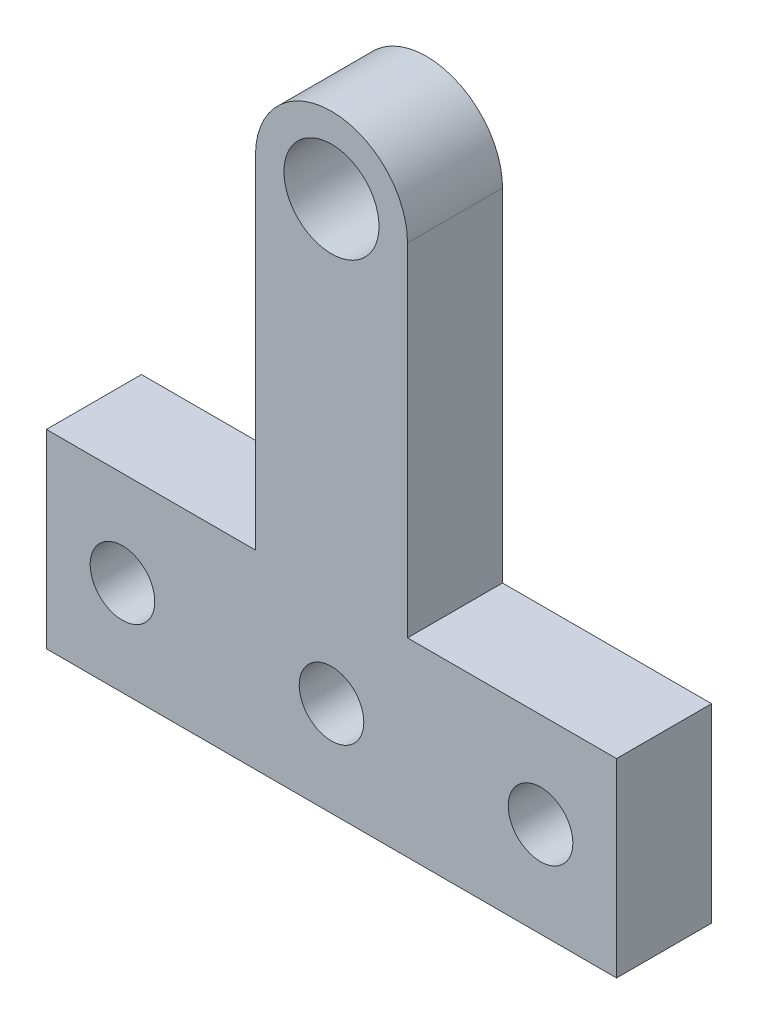
ISO-10303-21;
HEADER;
FILE_DESCRIPTION(('STEP AP214'),'2;1');
FILE_NAME('part.step','',(''),(''),'','','');
FILE_SCHEMA(('AUTOMOTIVE_DESIGN { 1 0 10303 214 1 1 1 1 }'));
ENDSEC;
DATA;
#1=APPLICATION_CONTEXT('core data for automotive mechanical design processes');
#2=APPLICATION_PROTOCOL_DEFINITION('international standard','automotive_design',2000,#1);
#3=PRODUCT_CONTEXT('',#1,'mechanical');
#4=PRODUCT('Part','Part','',(#3));
#5=PRODUCT_RELATED_PRODUCT_CATEGORY('part','',(#4));
#6=PRODUCT_DEFINITION_FORMATION('','',#4);
#7=PRODUCT_DEFINITION_CONTEXT('part definition',#1,'design');
#8=PRODUCT_DEFINITION('design','',#6,#7);
#9=PRODUCT_DEFINITION_SHAPE('','',#8);
#10=(LENGTH_UNIT() NAMED_UNIT(*) SI_UNIT(.MILLI.,.METRE.));
#11=(NAMED_UNIT(*) PLANE_ANGLE_UNIT() SI_UNIT($,.RADIAN.));
#12=(NAMED_UNIT(*) SI_UNIT($,.STERADIAN.) SOLID_ANGLE_UNIT());
#13=UNCERTAINTY_MEASURE_WITH_UNIT(LENGTH_MEASURE(1.E-05),#10,'distance_accuracy_value','');
#14=(GEOMETRIC_REPRESENTATION_CONTEXT(3) GLOBAL_UNCERTAINTY_ASSIGNED_CONTEXT((#13)) GLOBAL_UNIT_ASSIGNED_CONTEXT((#10,
#11,#12)) REPRESENTATION_CONTEXT('',''));
#15=CARTESIAN_POINT('',(0.,0.,0.));
#16=DIRECTION('',(0.,0.,1.));
#17=DIRECTION('',(1.,0.,0.));
#18=AXIS2_PLACEMENT_3D('',#15,#16,#17);
#19=CARTESIAN_POINT('',(0.,28.,0.));
#20=DIRECTION('',(0.,0.,1.));
#21=DIRECTION('',(1.,0.,0.));
#22=AXIS2_PLACEMENT_3D('',#19,#20,#21);
#23=PLANE('',#22);
#24=CARTESIAN_POINT('',(0.,28.,0.));
#25=DIRECTION('',(0.,0.,1.));
#26=DIRECTION('',(1.,0.,0.));
#27=AXIS2_PLACEMENT_3D('',#24,#25,#26);
#28=CIRCLE('',#27,2.5);
#29=CARTESIAN_POINT('',(2.5,28.,0.));
#30=VERTEX_POINT('',#29);
#31=EDGE_CURVE('E136',#30,#30,#28,.T.);
#32=ORIENTED_EDGE('',*,*,#31,.T.);
#33=EDGE_LOOP('',(#32));
#34=FACE_BOUND('',#33,.T.);
#35=DIRECTION('',(0.,1.,0.));
#36=VECTOR('',#35,1.);
#37=CARTESIAN_POINT('',(15.,10.,0.));
#38=LINE('',#37,#36);
#39=CARTESIAN_POINT('',(15.,0.,0.));
#40=VERTEX_POINT('',#39);
#41=CARTESIAN_POINT('',(15.,10.,0.));
#42=VERTEX_POINT('',#41);
#43=EDGE_CURVE('E132',#40,#42,#38,.T.);
#44=ORIENTED_EDGE('',*,*,#43,.F.);
#45=DIRECTION('',(1.,0.,0.));
#46=VECTOR('',#45,1.);
#47=CARTESIAN_POINT('',(15.,0.,0.));
#48=LINE('',#47,#46);
#49=CARTESIAN_POINT('',(-15.,0.,0.));
#50=VERTEX_POINT('',#49);
#51=EDGE_CURVE('E87',#50,#40,#48,.T.);
#52=ORIENTED_EDGE('',*,*,#51,.F.);
#53=DIRECTION('',(0.,-1.,0.));
#54=VECTOR('',#53,1.);
#55=CARTESIAN_POINT('',(-15.,0.,0.));
#56=LINE('',#55,#54);
#57=CARTESIAN_POINT('',(-15.,10.,0.));
#58=VERTEX_POINT('',#57);
#59=EDGE_CURVE('E81',#58,#50,#56,.T.);
#60=ORIENTED_EDGE('',*,*,#59,.F.);
#61=DIRECTION('',(-1.,0.,0.));
#62=VECTOR('',#61,1.);
#63=CARTESIAN_POINT('',(-15.,10.,0.));
#64=LINE('',#63,#62);
#65=CARTESIAN_POINT('',(-4.,10.,0.));
#66=VERTEX_POINT('',#65);
#67=EDGE_CURVE('E122',#66,#58,#64,.T.);
#68=ORIENTED_EDGE('',*,*,#67,.F.);
#69=DIRECTION('',(0.,-1.,0.));
#70=VECTOR('',#69,1.);
#71=CARTESIAN_POINT('',(-4.,28.,0.));
#72=LINE('',#71,#70);
#73=CARTESIAN_POINT('',(-4.,28.,0.));
#74=VERTEX_POINT('',#73);
#75=EDGE_CURVE('E142',#74,#66,#72,.T.);
#76=ORIENTED_EDGE('',*,*,#75,.F.);
#77=CARTESIAN_POINT('',(0.,28.,0.));
#78=DIRECTION('',(0.,0.,1.));
#79=DIRECTION('',(1.,0.,0.));
#80=AXIS2_PLACEMENT_3D('',#77,#78,#79);
#81=CIRCLE('',#80,4.);
#82=CARTESIAN_POINT('',(4.,28.,0.));
#83=VERTEX_POINT('',#82);
#84=EDGE_CURVE('E140',#83,#74,#81,.T.);
#85=ORIENTED_EDGE('',*,*,#84,.F.);
#86=DIRECTION('',(0.,1.,0.));
#87=VECTOR('',#86,1.);
#88=CARTESIAN_POINT('',(4.,10.,0.));
#89=LINE('',#88,#87);
#90=CARTESIAN_POINT('',(4.,10.,0.));
#91=VERTEX_POINT('',#90);
#92=EDGE_CURVE('E138',#91,#83,#89,.T.);
#93=ORIENTED_EDGE('',*,*,#92,.F.);
#94=DIRECTION('',(-1.,0.,0.));
#95=VECTOR('',#94,1.);
#96=CARTESIAN_POINT('',(4.,10.,0.));
#97=LINE('',#96,#95);
#98=EDGE_CURVE('E135',#42,#91,#97,.T.);
#99=ORIENTED_EDGE('',*,*,#98,.F.);
#100=EDGE_LOOP('',(#44,#52,#60,#68,#76,#85,#93,#99));
#101=FACE_BOUND('',#100,.T.);
#102=CARTESIAN_POINT('',(11.,5.,0.));
#103=DIRECTION('',(0.,0.,-1.));
#104=DIRECTION('',(-1.,0.,0.));
#105=AXIS2_PLACEMENT_3D('',#102,#103,#104);
#106=CIRCLE('',#105,3.15);
#107=CARTESIAN_POINT('',(7.85,5.,0.));
#108=VERTEX_POINT('',#107);
#109=EDGE_CURVE('E191',#108,#108,#106,.T.);
#110=ORIENTED_EDGE('',*,*,#109,.F.);
#111=EDGE_LOOP('',(#110));
#112=FACE_BOUND('',#111,.T.);
#113=CARTESIAN_POINT('',(-11.,5.,0.));
#114=DIRECTION('',(0.,0.,-1.));
#115=DIRECTION('',(-1.,0.,0.));
#116=AXIS2_PLACEMENT_3D('',#113,#114,#115);
#117=CIRCLE('',#116,3.15);
#118=CARTESIAN_POINT('',(-14.15,5.,0.));
#119=VERTEX_POINT('',#118);
#120=EDGE_CURVE('E200',#119,#119,#117,.T.);
#121=ORIENTED_EDGE('',*,*,#120,.F.);
#122=EDGE_LOOP('',(#121));
#123=FACE_BOUND('',#122,.T.);
#124=CARTESIAN_POINT('',(0.,5.,0.));
#125=DIRECTION('',(0.,0.,-1.));
#126=DIRECTION('',(-1.,0.,0.));
#127=AXIS2_PLACEMENT_3D('',#124,#125,#126);
#128=CIRCLE('',#127,3.15);
#129=CARTESIAN_POINT('',(-3.15,5.,0.));
#130=VERTEX_POINT('',#129);
#131=EDGE_CURVE('E209',#130,#130,#128,.T.);
#132=ORIENTED_EDGE('',*,*,#131,.F.);
#133=EDGE_LOOP('',(#132));
#134=FACE_BOUND('',#133,.T.);
#135=ADVANCED_FACE('F35',(#34,#101,#112,#123,#134),#23,.F.);
#136=CARTESIAN_POINT('',(15.,10.,5.));
#137=DIRECTION('',(-1.,0.,0.));
#138=DIRECTION('',(0.,-1.,0.));
#139=AXIS2_PLACEMENT_3D('',#136,#137,#138);
#140=PLANE('',#139);
#141=ORIENTED_EDGE('',*,*,#43,.T.);
#142=DIRECTION('',(0.,0.,-1.));
#143=VECTOR('',#142,1.);
#144=CARTESIAN_POINT('',(15.,10.,5.));
#145=LINE('',#144,#143);
#146=CARTESIAN_POINT('',(15.,10.,5.));
#147=VERTEX_POINT('',#146);
#148=EDGE_CURVE('E11',#147,#42,#145,.T.);
#149=ORIENTED_EDGE('',*,*,#148,.F.);
#150=DIRECTION('',(0.,1.,0.));
#151=VECTOR('',#150,1.);
#152=CARTESIAN_POINT('',(15.,10.,5.));
#153=LINE('',#152,#151);
#154=CARTESIAN_POINT('',(15.,0.,5.));
#155=VERTEX_POINT('',#154);
#156=EDGE_CURVE('E147',#155,#147,#153,.T.);
#157=ORIENTED_EDGE('',*,*,#156,.F.);
#158=DIRECTION('',(0.,0.,-1.));
#159=VECTOR('',#158,1.);
#160=CARTESIAN_POINT('',(15.,0.,5.));
#161=LINE('',#160,#159);
#162=EDGE_CURVE('E128',#155,#40,#161,.T.);
#163=ORIENTED_EDGE('',*,*,#162,.T.);
#164=EDGE_LOOP('',(#141,#149,#157,#163));
#165=FACE_BOUND('',#164,.T.);
#166=ADVANCED_FACE('F37',(#165),#140,.F.);
#167=CARTESIAN_POINT('',(4.,10.,5.));
#168=DIRECTION('',(0.,-1.,0.));
#169=DIRECTION('',(1.,0.,0.));
#170=AXIS2_PLACEMENT_3D('',#167,#168,#169);
#171=PLANE('',#170);
#172=ORIENTED_EDGE('',*,*,#98,.T.);
#173=DIRECTION('',(0.,0.,-1.));
#174=VECTOR('',#173,1.);
#175=CARTESIAN_POINT('',(4.,10.,5.));
#176=LINE('',#175,#174);
#177=CARTESIAN_POINT('',(4.,10.,5.));
#178=VERTEX_POINT('',#177);
#179=EDGE_CURVE('E44',#178,#91,#176,.T.);
#180=ORIENTED_EDGE('',*,*,#179,.F.);
#181=DIRECTION('',(-1.,0.,0.));
#182=VECTOR('',#181,1.);
#183=CARTESIAN_POINT('',(4.,10.,5.));
#184=LINE('',#183,#182);
#185=EDGE_CURVE('E95',#147,#178,#184,.T.);
#186=ORIENTED_EDGE('',*,*,#185,.F.);
#187=ORIENTED_EDGE('',*,*,#148,.T.);
#188=EDGE_LOOP('',(#172,#180,#186,#187));
#189=FACE_BOUND('',#188,.T.);
#190=ADVANCED_FACE('F221',(#189),#171,.F.);
#191=CARTESIAN_POINT('',(4.,10.,5.));
#192=DIRECTION('',(-1.,0.,0.));
#193=DIRECTION('',(0.,0.,1.));
#194=AXIS2_PLACEMENT_3D('',#191,#192,#193);
#195=PLANE('',#194);
#196=ORIENTED_EDGE('',*,*,#92,.T.);
#197=DIRECTION('',(0.,0.,-1.));
#198=VECTOR('',#197,1.);
#199=CARTESIAN_POINT('',(4.,28.,5.));
#200=LINE('',#199,#198);
#201=CARTESIAN_POINT('',(4.,28.,5.));
#202=VERTEX_POINT('',#201);
#203=EDGE_CURVE('E154',#202,#83,#200,.T.);
#204=ORIENTED_EDGE('',*,*,#203,.F.);
#205=DIRECTION('',(0.,1.,0.));
#206=VECTOR('',#205,1.);
#207=CARTESIAN_POINT('',(4.,10.,5.));
#208=LINE('',#207,#206);
#209=EDGE_CURVE('E162',#178,#202,#208,.T.);
#210=ORIENTED_EDGE('',*,*,#209,.F.);
#211=ORIENTED_EDGE('',*,*,#179,.T.);
#212=EDGE_LOOP('',(#196,#204,#210,#211));
#213=FACE_BOUND('',#212,.T.);
#214=ADVANCED_FACE('F160',(#213),#195,.F.);
#215=CARTESIAN_POINT('',(0.,28.,5.));
#216=DIRECTION('',(0.,0.,-1.));
#217=DIRECTION('',(-1.,0.,0.));
#218=AXIS2_PLACEMENT_3D('',#215,#216,#217);
#219=CYLINDRICAL_SURFACE('',#218,4.);
#220=ORIENTED_EDGE('',*,*,#84,.T.);
#221=DIRECTION('',(0.,0.,-1.));
#222=VECTOR('',#221,1.);
#223=CARTESIAN_POINT('',(-4.,28.,5.));
#224=LINE('',#223,#222);
#225=CARTESIAN_POINT('',(-4.,28.,5.));
#226=VERTEX_POINT('',#225);
#227=EDGE_CURVE('E151',#226,#74,#224,.T.);
#228=ORIENTED_EDGE('',*,*,#227,.F.);
#229=CARTESIAN_POINT('',(0.,28.,5.));
#230=DIRECTION('',(0.,0.,1.));
#231=DIRECTION('',(1.,0.,0.));
#232=AXIS2_PLACEMENT_3D('',#229,#230,#231);
#233=CIRCLE('',#232,4.);
#234=EDGE_CURVE('E174',#202,#226,#233,.T.);
#235=ORIENTED_EDGE('',*,*,#234,.F.);
#236=ORIENTED_EDGE('',*,*,#203,.T.);
#237=EDGE_LOOP('',(#220,#228,#235,#236));
#238=FACE_BOUND('',#237,.T.);
#239=ADVANCED_FACE('F170',(#238),#219,.T.);
#240=CARTESIAN_POINT('',(-4.,28.,5.));
#241=DIRECTION('',(1.,0.,0.));
#242=DIRECTION('',(0.,1.,0.));
#243=AXIS2_PLACEMENT_3D('',#240,#241,#242);
#244=PLANE('',#243);
#245=ORIENTED_EDGE('',*,*,#75,.T.);
#246=DIRECTION('',(0.,0.,-1.));
#247=VECTOR('',#246,1.);
#248=CARTESIAN_POINT('',(-4.,10.,5.));
#249=LINE('',#248,#247);
#250=CARTESIAN_POINT('',(-4.,10.,5.));
#251=VERTEX_POINT('',#250);
#252=EDGE_CURVE('E123',#251,#66,#249,.T.);
#253=ORIENTED_EDGE('',*,*,#252,.F.);
#254=DIRECTION('',(0.,-1.,0.));
#255=VECTOR('',#254,1.);
#256=CARTESIAN_POINT('',(-4.,28.,5.));
#257=LINE('',#256,#255);
#258=EDGE_CURVE('E114',#226,#251,#257,.T.);
#259=ORIENTED_EDGE('',*,*,#258,.F.);
#260=ORIENTED_EDGE('',*,*,#227,.T.);
#261=EDGE_LOOP('',(#245,#253,#259,#260));
#262=FACE_BOUND('',#261,.T.);
#263=ADVANCED_FACE('F173',(#262),#244,.F.);
#264=CARTESIAN_POINT('',(-15.,10.,5.));
#265=DIRECTION('',(0.,-1.,0.));
#266=DIRECTION('',(0.,0.,-1.));
#267=AXIS2_PLACEMENT_3D('',#264,#265,#266);
#268=PLANE('',#267);
#269=ORIENTED_EDGE('',*,*,#67,.T.);
#270=DIRECTION('',(0.,0.,-1.));
#271=VECTOR('',#270,1.);
#272=CARTESIAN_POINT('',(-15.,10.,5.));
#273=LINE('',#272,#271);
#274=CARTESIAN_POINT('',(-15.,10.,5.));
#275=VERTEX_POINT('',#274);
#276=EDGE_CURVE('E119',#275,#58,#273,.T.);
#277=ORIENTED_EDGE('',*,*,#276,.F.);
#278=DIRECTION('',(-1.,0.,0.));
#279=VECTOR('',#278,1.);
#280=CARTESIAN_POINT('',(-15.,10.,5.));
#281=LINE('',#280,#279);
#282=EDGE_CURVE('E108',#251,#275,#281,.T.);
#283=ORIENTED_EDGE('',*,*,#282,.F.);
#284=ORIENTED_EDGE('',*,*,#252,.T.);
#285=EDGE_LOOP('',(#269,#277,#283,#284));
#286=FACE_BOUND('',#285,.T.);
#287=ADVANCED_FACE('F120',(#286),#268,.F.);
#288=CARTESIAN_POINT('',(-15.,0.,5.));
#289=DIRECTION('',(1.,0.,0.));
#290=DIRECTION('',(0.,0.,-1.));
#291=AXIS2_PLACEMENT_3D('',#288,#289,#290);
#292=PLANE('',#291);
#293=ORIENTED_EDGE('',*,*,#59,.T.);
#294=DIRECTION('',(0.,0.,-1.));
#295=VECTOR('',#294,1.);
#296=CARTESIAN_POINT('',(-15.,0.,5.));
#297=LINE('',#296,#295);
#298=CARTESIAN_POINT('',(-15.,0.,5.));
#299=VERTEX_POINT('',#298);
#300=EDGE_CURVE('E124',#299,#50,#297,.T.);
#301=ORIENTED_EDGE('',*,*,#300,.F.);
#302=DIRECTION('',(0.,-1.,0.));
#303=VECTOR('',#302,1.);
#304=CARTESIAN_POINT('',(-15.,0.,5.));
#305=LINE('',#304,#303);
#306=EDGE_CURVE('E112',#275,#299,#305,.T.);
#307=ORIENTED_EDGE('',*,*,#306,.F.);
#308=ORIENTED_EDGE('',*,*,#276,.T.);
#309=EDGE_LOOP('',(#293,#301,#307,#308));
#310=FACE_BOUND('',#309,.T.);
#311=ADVANCED_FACE('F126',(#310),#292,.F.);
#312=CARTESIAN_POINT('',(15.,0.,5.));
#313=DIRECTION('',(0.,1.,0.));
#314=DIRECTION('',(-1.,0.,0.));
#315=AXIS2_PLACEMENT_3D('',#312,#313,#314);
#316=PLANE('',#315);
#317=ORIENTED_EDGE('',*,*,#51,.T.);
#318=ORIENTED_EDGE('',*,*,#162,.F.);
#319=DIRECTION('',(1.,0.,0.));
#320=VECTOR('',#319,1.);
#321=CARTESIAN_POINT('',(15.,0.,5.));
#322=LINE('',#321,#320);
#323=EDGE_CURVE('E52',#299,#155,#322,.T.);
#324=ORIENTED_EDGE('',*,*,#323,.F.);
#325=ORIENTED_EDGE('',*,*,#300,.T.);
#326=EDGE_LOOP('',(#317,#318,#324,#325));
#327=FACE_BOUND('',#326,.T.);
#328=ADVANCED_FACE('F226',(#327),#316,.F.);
#329=CARTESIAN_POINT('',(0.,28.,5.));
#330=DIRECTION('',(0.,0.,1.));
#331=DIRECTION('',(1.,0.,0.));
#332=AXIS2_PLACEMENT_3D('',#329,#330,#331);
#333=PLANE('',#332);
#334=CARTESIAN_POINT('',(0.,5.,5.));
#335=DIRECTION('',(0.,0.,1.));
#336=DIRECTION('',(1.,0.,0.));
#337=AXIS2_PLACEMENT_3D('',#334,#335,#336);
#338=CIRCLE('',#337,1.7);
#339=CARTESIAN_POINT('',(1.7,5.,5.));
#340=VERTEX_POINT('',#339);
#341=EDGE_CURVE('E203',#340,#340,#338,.T.);
#342=ORIENTED_EDGE('',*,*,#341,.F.);
#343=EDGE_LOOP('',(#342));
#344=FACE_BOUND('',#343,.T.);
#345=CARTESIAN_POINT('',(-11.,5.,5.));
#346=DIRECTION('',(0.,0.,1.));
#347=DIRECTION('',(1.,0.,0.));
#348=AXIS2_PLACEMENT_3D('',#345,#346,#347);
#349=CIRCLE('',#348,1.7);
#350=CARTESIAN_POINT('',(-9.3,5.,5.));
#351=VERTEX_POINT('',#350);
#352=EDGE_CURVE('E194',#351,#351,#349,.T.);
#353=ORIENTED_EDGE('',*,*,#352,.F.);
#354=EDGE_LOOP('',(#353));
#355=FACE_BOUND('',#354,.T.);
#356=CARTESIAN_POINT('',(11.,5.,5.));
#357=DIRECTION('',(0.,0.,1.));
#358=DIRECTION('',(1.,0.,0.));
#359=AXIS2_PLACEMENT_3D('',#356,#357,#358);
#360=CIRCLE('',#359,1.7);
#361=CARTESIAN_POINT('',(12.7,5.,5.));
#362=VERTEX_POINT('',#361);
#363=EDGE_CURVE('E183',#362,#362,#360,.T.);
#364=ORIENTED_EDGE('',*,*,#363,.F.);
#365=EDGE_LOOP('',(#364));
#366=FACE_BOUND('',#365,.T.);
#367=CARTESIAN_POINT('',(0.,28.,5.));
#368=DIRECTION('',(0.,0.,1.));
#369=DIRECTION('',(1.,0.,0.));
#370=AXIS2_PLACEMENT_3D('',#367,#368,#369);
#371=CIRCLE('',#370,2.5);
#372=CARTESIAN_POINT('',(2.5,28.,5.));
#373=VERTEX_POINT('',#372);
#374=EDGE_CURVE('E180',#373,#373,#371,.T.);
#375=ORIENTED_EDGE('',*,*,#374,.F.);
#376=EDGE_LOOP('',(#375));
#377=FACE_BOUND('',#376,.T.);
#378=ORIENTED_EDGE('',*,*,#156,.T.);
#379=ORIENTED_EDGE('',*,*,#185,.T.);
#380=ORIENTED_EDGE('',*,*,#209,.T.);
#381=ORIENTED_EDGE('',*,*,#234,.T.);
#382=ORIENTED_EDGE('',*,*,#258,.T.);
#383=ORIENTED_EDGE('',*,*,#282,.T.);
#384=ORIENTED_EDGE('',*,*,#306,.T.);
#385=ORIENTED_EDGE('',*,*,#323,.T.);
#386=EDGE_LOOP('',(#378,#379,#380,#381,#382,#383,#384,#385));
#387=FACE_BOUND('',#386,.T.);
#388=ADVANCED_FACE('F110',(#344,#355,#366,#377,#387),#333,.T.);
#389=CARTESIAN_POINT('',(0.,28.,0.));
#390=DIRECTION('',(0.,0.,1.));
#391=DIRECTION('',(1.,0.,0.));
#392=AXIS2_PLACEMENT_3D('',#389,#390,#391);
#393=CYLINDRICAL_SURFACE('',#392,2.5);
#394=ORIENTED_EDGE('',*,*,#31,.F.);
#395=EDGE_LOOP('',(#394));
#396=FACE_BOUND('',#395,.T.);
#397=ORIENTED_EDGE('',*,*,#374,.T.);
#398=EDGE_LOOP('',(#397));
#399=FACE_BOUND('',#398,.T.);
#400=ADVANCED_FACE('F276',(#396,#399),#393,.F.);
#401=CARTESIAN_POINT('',(11.,5.,0.));
#402=DIRECTION('',(0.,0.,-1.));
#403=DIRECTION('',(-1.,0.,0.));
#404=AXIS2_PLACEMENT_3D('',#401,#402,#403);
#405=CYLINDRICAL_SURFACE('',#404,1.7);
#406=CARTESIAN_POINT('',(11.,5.,1.45));
#407=DIRECTION('',(0.,0.,-1.));
#408=DIRECTION('',(-1.,0.,0.));
#409=AXIS2_PLACEMENT_3D('',#406,#407,#408);
#410=CIRCLE('',#409,1.7);
#411=CARTESIAN_POINT('',(9.3,5.,1.45));
#412=VERTEX_POINT('',#411);
#413=EDGE_CURVE('E188',#412,#412,#410,.T.);
#414=ORIENTED_EDGE('',*,*,#413,.T.);
#415=EDGE_LOOP('',(#414));
#416=FACE_BOUND('',#415,.T.);
#417=ORIENTED_EDGE('',*,*,#363,.T.);
#418=EDGE_LOOP('',(#417));
#419=FACE_BOUND('',#418,.T.);
#420=ADVANCED_FACE('F283',(#416,#419),#405,.F.);
#421=CARTESIAN_POINT('',(11.,5.,0.));
#422=DIRECTION('',(0.,0.,-1.));
#423=DIRECTION('',(-1.,0.,0.));
#424=AXIS2_PLACEMENT_3D('',#421,#422,#423);
#425=CONICAL_SURFACE('',#424,3.15,0.785398163397449);
#426=ORIENTED_EDGE('',*,*,#413,.F.);
#427=EDGE_LOOP('',(#426));
#428=FACE_BOUND('',#427,.T.);
#429=ORIENTED_EDGE('',*,*,#109,.T.);
#430=EDGE_LOOP('',(#429));
#431=FACE_BOUND('',#430,.T.);
#432=ADVANCED_FACE('F289',(#428,#431),#425,.F.);
#433=CARTESIAN_POINT('',(-11.,5.,0.));
#434=DIRECTION('',(0.,0.,-1.));
#435=DIRECTION('',(-1.,0.,0.));
#436=AXIS2_PLACEMENT_3D('',#433,#434,#435);
#437=CYLINDRICAL_SURFACE('',#436,1.7);
#438=CARTESIAN_POINT('',(-11.,5.,1.45));
#439=DIRECTION('',(0.,0.,-1.));
#440=DIRECTION('',(-1.,0.,0.));
#441=AXIS2_PLACEMENT_3D('',#438,#439,#440);
#442=CIRCLE('',#441,1.7);
#443=CARTESIAN_POINT('',(-12.7,5.,1.45));
#444=VERTEX_POINT('',#443);
#445=EDGE_CURVE('E197',#444,#444,#442,.T.);
#446=ORIENTED_EDGE('',*,*,#445,.T.);
#447=EDGE_LOOP('',(#446));
#448=FACE_BOUND('',#447,.T.);
#449=ORIENTED_EDGE('',*,*,#352,.T.);
#450=EDGE_LOOP('',(#449));
#451=FACE_BOUND('',#450,.T.);
#452=ADVANCED_FACE('F297',(#448,#451),#437,.F.);
#453=CARTESIAN_POINT('',(-11.,5.,0.));
#454=DIRECTION('',(0.,0.,-1.));
#455=DIRECTION('',(-1.,0.,0.));
#456=AXIS2_PLACEMENT_3D('',#453,#454,#455);
#457=CONICAL_SURFACE('',#456,3.15,0.785398163397449);
#458=ORIENTED_EDGE('',*,*,#445,.F.);
#459=EDGE_LOOP('',(#458));
#460=FACE_BOUND('',#459,.T.);
#461=ORIENTED_EDGE('',*,*,#120,.T.);
#462=EDGE_LOOP('',(#461));
#463=FACE_BOUND('',#462,.T.);
#464=ADVANCED_FACE('F305',(#460,#463),#457,.F.);
#465=CARTESIAN_POINT('',(0.,5.,0.));
#466=DIRECTION('',(0.,0.,-1.));
#467=DIRECTION('',(-1.,0.,0.));
#468=AXIS2_PLACEMENT_3D('',#465,#466,#467);
#469=CYLINDRICAL_SURFACE('',#468,1.7);
#470=CARTESIAN_POINT('',(0.,5.,1.45));
#471=DIRECTION('',(0.,0.,-1.));
#472=DIRECTION('',(-1.,0.,0.));
#473=AXIS2_PLACEMENT_3D('',#470,#471,#472);
#474=CIRCLE('',#473,1.7);
#475=CARTESIAN_POINT('',(-1.7,5.,1.45));
#476=VERTEX_POINT('',#475);
#477=EDGE_CURVE('E206',#476,#476,#474,.T.);
#478=ORIENTED_EDGE('',*,*,#477,.T.);
#479=EDGE_LOOP('',(#478));
#480=FACE_BOUND('',#479,.T.);
#481=ORIENTED_EDGE('',*,*,#341,.T.);
#482=EDGE_LOOP('',(#481));
#483=FACE_BOUND('',#482,.T.);
#484=ADVANCED_FACE('F313',(#480,#483),#469,.F.);
#485=CARTESIAN_POINT('',(0.,5.,0.));
#486=DIRECTION('',(0.,0.,-1.));
#487=DIRECTION('',(-1.,0.,0.));
#488=AXIS2_PLACEMENT_3D('',#485,#486,#487);
#489=CONICAL_SURFACE('',#488,3.15,0.785398163397449);
#490=ORIENTED_EDGE('',*,*,#477,.F.);
#491=EDGE_LOOP('',(#490));
#492=FACE_BOUND('',#491,.T.);
#493=ORIENTED_EDGE('',*,*,#131,.T.);
#494=EDGE_LOOP('',(#493));
#495=FACE_BOUND('',#494,.T.);
#496=ADVANCED_FACE('F213',(#492,#495),#489,.F.);
#497=CLOSED_SHELL('',(#135,#166,#190,#214,#239,#263,#287,#311,#328,#388,#400,#420,#432,#452,
#464,#484,#496));
#498=MANIFOLD_SOLID_BREP('B2',#497);
#499=ADVANCED_BREP_SHAPE_REPRESENTATION('',(#18,#498),#14);
#500=SHAPE_DEFINITION_REPRESENTATION(#9,#499);
ENDSEC;
END-ISO-10303-21;
